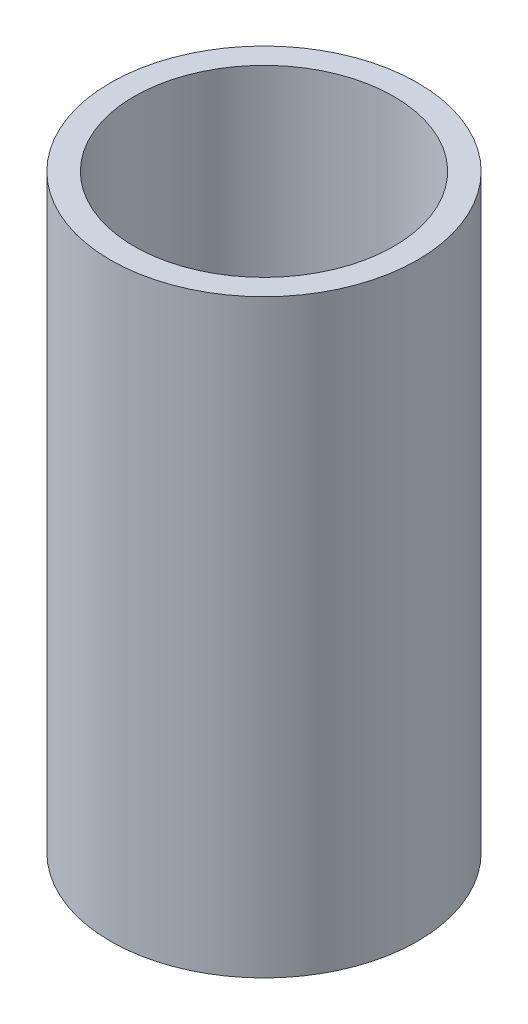
ISO-10303-21;
HEADER;
FILE_DESCRIPTION(('STEP AP214'),'2;1');
FILE_NAME('part.step','',(''),(''),'','','');
FILE_SCHEMA(('AUTOMOTIVE_DESIGN { 1 0 10303 214 1 1 1 1 }'));
ENDSEC;
DATA;
#1=APPLICATION_CONTEXT('core data for automotive mechanical design processes');
#2=APPLICATION_PROTOCOL_DEFINITION('international standard','automotive_design',2000,#1);
#3=PRODUCT_CONTEXT('',#1,'mechanical');
#4=PRODUCT('Part','Part','',(#3));
#5=PRODUCT_RELATED_PRODUCT_CATEGORY('part','',(#4));
#6=PRODUCT_DEFINITION_FORMATION('','',#4);
#7=PRODUCT_DEFINITION_CONTEXT('part definition',#1,'design');
#8=PRODUCT_DEFINITION('design','',#6,#7);
#9=PRODUCT_DEFINITION_SHAPE('','',#8);
#10=(LENGTH_UNIT() NAMED_UNIT(*) SI_UNIT(.MILLI.,.METRE.));
#11=(NAMED_UNIT(*) PLANE_ANGLE_UNIT() SI_UNIT($,.RADIAN.));
#12=(NAMED_UNIT(*) SI_UNIT($,.STERADIAN.) SOLID_ANGLE_UNIT());
#13=UNCERTAINTY_MEASURE_WITH_UNIT(LENGTH_MEASURE(1.E-05),#10,'distance_accuracy_value','');
#14=(GEOMETRIC_REPRESENTATION_CONTEXT(3) GLOBAL_UNCERTAINTY_ASSIGNED_CONTEXT((#13)) GLOBAL_UNIT_ASSIGNED_CONTEXT((#10,
#11,#12)) REPRESENTATION_CONTEXT('',''));
#15=CARTESIAN_POINT('',(0.,0.,0.));
#16=DIRECTION('',(0.,0.,1.));
#17=DIRECTION('',(1.,0.,0.));
#18=AXIS2_PLACEMENT_3D('',#15,#16,#17);
#19=CARTESIAN_POINT('',(0.,124.88153941635,0.));
#20=DIRECTION('',(0.,-1.,0.));
#21=DIRECTION('',(0.,0.,-1.));
#22=AXIS2_PLACEMENT_3D('',#19,#20,#21);
#23=CYLINDRICAL_SURFACE('',#22,32.5);
#24=CARTESIAN_POINT('',(0.,124.88153941635,0.));
#25=DIRECTION('',(0.,1.,0.));
#26=DIRECTION('',(0.,0.,1.));
#27=AXIS2_PLACEMENT_3D('',#24,#25,#26);
#28=CIRCLE('',#27,32.5);
#29=CARTESIAN_POINT('',(0.,124.88153941635,-32.5));
#30=VERTEX_POINT('',#29);
#31=EDGE_CURVE('E10',#30,#30,#28,.T.);
#32=CARTESIAN_POINT('',(0.,0.,0.));
#33=DIRECTION('',(0.,1.,0.));
#34=DIRECTION('',(0.,0.,1.));
#35=AXIS2_PLACEMENT_3D('',#32,#33,#34);
#36=CIRCLE('',#35,32.5);
#37=CARTESIAN_POINT('',(0.,0.,-32.5));
#38=VERTEX_POINT('',#37);
#39=EDGE_CURVE('E37',#38,#38,#36,.T.);
#40=CARTESIAN_POINT('',(0.,124.88153941635,-32.5));
#41=CARTESIAN_POINT('',(0.,123.58069004743,-32.5));
#42=CARTESIAN_POINT('',(0.,122.27984067851,-32.5));
#43=CARTESIAN_POINT('',(0.,119.678141940669,-32.5));
#44=CARTESIAN_POINT('',(0.,118.377292571749,-32.5));
#45=CARTESIAN_POINT('',(0.,115.775593833908,-32.5));
#46=CARTESIAN_POINT('',(0.,114.474744464988,-32.5));
#47=CARTESIAN_POINT('',(0.,111.873045727147,-32.5));
#48=CARTESIAN_POINT('',(0.,110.572196358227,-32.5));
#49=CARTESIAN_POINT('',(0.,107.970497620386,-32.5));
#50=CARTESIAN_POINT('',(0.,106.669648251466,-32.5));
#51=CARTESIAN_POINT('',(0.,104.067949513625,-32.5));
#52=CARTESIAN_POINT('',(0.,102.767100144705,-32.5));
#53=CARTESIAN_POINT('',(0.,100.165401406864,-32.5));
#54=CARTESIAN_POINT('',(0.,98.864552037944,-32.5));
#55=CARTESIAN_POINT('',(0.,96.2628533001034,-32.5));
#56=CARTESIAN_POINT('',(0.,94.962003931183,-32.5));
#57=CARTESIAN_POINT('',(0.,92.3603051933424,-32.5));
#58=CARTESIAN_POINT('',(0.,91.0594558244221,-32.5));
#59=CARTESIAN_POINT('',(0.,88.4577570865815,-32.5));
#60=CARTESIAN_POINT('',(0.,87.1569077176612,-32.5));
#61=CARTESIAN_POINT('',(0.,84.5552089798205,-32.5));
#62=CARTESIAN_POINT('',(0.,83.2543596109002,-32.5));
#63=CARTESIAN_POINT('',(0.,80.6526608730596,-32.5));
#64=CARTESIAN_POINT('',(0.,79.3518115041393,-32.5));
#65=CARTESIAN_POINT('',(0.,76.7501127662986,-32.5));
#66=CARTESIAN_POINT('',(0.,75.4492633973783,-32.5));
#67=CARTESIAN_POINT('',(0.,72.8475646595377,-32.5));
#68=CARTESIAN_POINT('',(0.,71.5467152906174,-32.5));
#69=CARTESIAN_POINT('',(0.,68.9450165527767,-32.5));
#70=CARTESIAN_POINT('',(0.,67.6441671838564,-32.5));
#71=CARTESIAN_POINT('',(0.,65.0424684460158,-32.5));
#72=CARTESIAN_POINT('',(0.,63.7416190770955,-32.5));
#73=CARTESIAN_POINT('',(0.,61.1399203392548,-32.5));
#74=CARTESIAN_POINT('',(0.,59.8390709703345,-32.5));
#75=CARTESIAN_POINT('',(0.,57.2373722324939,-32.5));
#76=CARTESIAN_POINT('',(0.,55.9365228635736,-32.5));
#77=CARTESIAN_POINT('',(0.,53.334824125733,-32.5));
#78=CARTESIAN_POINT('',(0.,52.0339747568126,-32.5));
#79=CARTESIAN_POINT('',(0.,49.432276018972,-32.5));
#80=CARTESIAN_POINT('',(0.,48.1314266500517,-32.5));
#81=CARTESIAN_POINT('',(0.,45.5297279122111,-32.5));
#82=CARTESIAN_POINT('',(0.,44.2288785432907,-32.5));
#83=CARTESIAN_POINT('',(0.,41.6271798054501,-32.5));
#84=CARTESIAN_POINT('',(0.,40.3263304365298,-32.5));
#85=CARTESIAN_POINT('',(0.,37.7246316986892,-32.5));
#86=CARTESIAN_POINT('',(0.,36.4237823297688,-32.5));
#87=CARTESIAN_POINT('',(0.,33.8220835919282,-32.5));
#88=CARTESIAN_POINT('',(0.,32.5212342230079,-32.5));
#89=CARTESIAN_POINT('',(0.,29.9195354851673,-32.5));
#90=CARTESIAN_POINT('',(0.,28.6186861162469,-32.5));
#91=CARTESIAN_POINT('',(0.,26.0169873784063,-32.5));
#92=CARTESIAN_POINT('',(0.,24.716138009486,-32.5));
#93=CARTESIAN_POINT('',(0.,22.1144392716454,-32.5));
#94=CARTESIAN_POINT('',(0.,20.813589902725,-32.5));
#95=CARTESIAN_POINT('',(0.,18.2118911648844,-32.5));
#96=CARTESIAN_POINT('',(0.,16.9110417959641,-32.5));
#97=CARTESIAN_POINT('',(0.,14.3093430581235,-32.5));
#98=CARTESIAN_POINT('',(0.,13.0084936892031,-32.5));
#99=CARTESIAN_POINT('',(0.,10.4067949513625,-32.5));
#100=CARTESIAN_POINT('',(0.,9.1059455824422,-32.5));
#101=CARTESIAN_POINT('',(0.,6.50424684460157,-32.5));
#102=CARTESIAN_POINT('',(0.,5.20339747568125,-32.5));
#103=CARTESIAN_POINT('',(0.,2.60169873784062,-32.5));
#104=CARTESIAN_POINT('',(0.,1.3008493689203,-32.5));
#105=CARTESIAN_POINT('',(0.,0.,-32.5));
#106=B_SPLINE_CURVE_WITH_KNOTS('',3,(#40,#41,#42,#43,#44,#45,#46,#47,#48,#49,#50,#51,#52,#53,
#54,#55,#56,#57,#58,#59,#60,#61,#62,#63,#64,#65,#66,#67,#68,#69,#70,#71,#72,#73,#74,#75,#76,#77,
#78,#79,#80,#81,#82,#83,#84,#85,#86,#87,#88,#89,#90,#91,#92,#93,#94,#95,#96,#97,#98,#99,#100,
#101,#102,#103,#104,#105),.UNSPECIFIED.,.F.,.F.,(4,2,2,2,2,2,2,2,2,2,2,2,2,2,2,2,2,2,2,2,2,2,2,
2,2,2,2,2,2,2,2,2,4),(0.,3.90254810676094,7.80509621352189,11.7076443202828,15.6101924270438,
19.5127405338047,23.4152886405657,27.3178367473266,31.2203848540876,35.1229329608485,
39.0254810676095,42.9280291743704,46.8305772811314,50.7331253878923,54.6356734946533,
58.5382216014142,62.4407697081752,66.3433178149361,70.2458659216971,74.148414028458,
78.050962135219,81.9535102419799,85.8560583487408,89.7586064555018,93.6611545622628,
97.5637026690237,101.466250775785,105.368798882546,109.271346989307,113.173895096067,
117.076443202828,120.978991309589,124.88153941635),.UNSPECIFIED.);
#107=EDGE_CURVE('BSEAM40',#30,#38,#106,.T.);
#108=ORIENTED_EDGE('',*,*,#31,.F.);
#109=ORIENTED_EDGE('',*,*,#39,.T.);
#110=ORIENTED_EDGE('',*,*,#107,.T.);
#111=ORIENTED_EDGE('',*,*,#107,.F.);
#112=EDGE_LOOP('',(#108,#110,#109,#111));
#113=FACE_BOUND('',#112,.T.);
#114=ADVANCED_FACE('F40',(#113),#23,.T.);
#115=CARTESIAN_POINT('',(0.,124.88153941635,0.));
#116=DIRECTION('',(0.,1.,0.));
#117=DIRECTION('',(0.,0.,1.));
#118=AXIS2_PLACEMENT_3D('',#115,#116,#117);
#119=PLANE('',#118);
#120=CARTESIAN_POINT('',(0.,124.88153941635,0.));
#121=DIRECTION('',(0.,1.,0.));
#122=DIRECTION('',(0.,0.,1.));
#123=AXIS2_PLACEMENT_3D('',#120,#121,#122);
#124=CIRCLE('',#123,27.4878555200863);
#125=CARTESIAN_POINT('',(0.,124.88153941635,-27.4878555200863));
#126=VERTEX_POINT('',#125);
#127=EDGE_CURVE('E50',#126,#126,#124,.T.);
#128=ORIENTED_EDGE('',*,*,#127,.F.);
#129=EDGE_LOOP('',(#128));
#130=FACE_BOUND('',#129,.T.);
#131=ORIENTED_EDGE('',*,*,#31,.T.);
#132=EDGE_LOOP('',(#131));
#133=FACE_BOUND('',#132,.T.);
#134=ADVANCED_FACE('F59',(#130,#133),#119,.T.);
#135=CARTESIAN_POINT('',(0.,0.,0.));
#136=DIRECTION('',(0.,1.,0.));
#137=DIRECTION('',(0.,0.,1.));
#138=AXIS2_PLACEMENT_3D('',#135,#136,#137);
#139=PLANE('',#138);
#140=CARTESIAN_POINT('',(0.,0.,0.));
#141=DIRECTION('',(0.,1.,0.));
#142=DIRECTION('',(0.,0.,1.));
#143=AXIS2_PLACEMENT_3D('',#140,#141,#142);
#144=CIRCLE('',#143,27.4878555200863);
#145=CARTESIAN_POINT('',(0.,0.,-27.4878555200863));
#146=VERTEX_POINT('',#145);
#147=EDGE_CURVE('E47',#146,#146,#144,.T.);
#148=ORIENTED_EDGE('',*,*,#147,.T.);
#149=EDGE_LOOP('',(#148));
#150=FACE_BOUND('',#149,.T.);
#151=ORIENTED_EDGE('',*,*,#39,.F.);
#152=EDGE_LOOP('',(#151));
#153=FACE_BOUND('',#152,.T.);
#154=ADVANCED_FACE('F58',(#150,#153),#139,.F.);
#155=CARTESIAN_POINT('',(0.,124.88153941635,0.));
#156=DIRECTION('',(0.,-1.,0.));
#157=DIRECTION('',(0.,0.,-1.));
#158=AXIS2_PLACEMENT_3D('',#155,#156,#157);
#159=CYLINDRICAL_SURFACE('',#158,27.4878555200863);
#160=CARTESIAN_POINT('',(0.,124.88153941635,-27.4878555200863));
#161=CARTESIAN_POINT('',(0.,123.58069004743,-27.4878555200863));
#162=CARTESIAN_POINT('',(0.,122.27984067851,-27.4878555200863));
#163=CARTESIAN_POINT('',(0.,119.678141940669,-27.4878555200863));
#164=CARTESIAN_POINT('',(0.,118.377292571749,-27.4878555200863));
#165=CARTESIAN_POINT('',(0.,115.775593833908,-27.4878555200863));
#166=CARTESIAN_POINT('',(0.,114.474744464988,-27.4878555200863));
#167=CARTESIAN_POINT('',(0.,111.873045727147,-27.4878555200863));
#168=CARTESIAN_POINT('',(0.,110.572196358227,-27.4878555200863));
#169=CARTESIAN_POINT('',(0.,107.970497620386,-27.4878555200863));
#170=CARTESIAN_POINT('',(0.,106.669648251466,-27.4878555200863));
#171=CARTESIAN_POINT('',(0.,104.067949513625,-27.4878555200863));
#172=CARTESIAN_POINT('',(0.,102.767100144705,-27.4878555200863));
#173=CARTESIAN_POINT('',(0.,100.165401406864,-27.4878555200863));
#174=CARTESIAN_POINT('',(0.,98.864552037944,-27.4878555200863));
#175=CARTESIAN_POINT('',(0.,96.2628533001034,-27.4878555200863));
#176=CARTESIAN_POINT('',(0.,94.962003931183,-27.4878555200863));
#177=CARTESIAN_POINT('',(0.,92.3603051933424,-27.4878555200863));
#178=CARTESIAN_POINT('',(0.,91.0594558244221,-27.4878555200863));
#179=CARTESIAN_POINT('',(0.,88.4577570865815,-27.4878555200863));
#180=CARTESIAN_POINT('',(0.,87.1569077176612,-27.4878555200863));
#181=CARTESIAN_POINT('',(0.,84.5552089798205,-27.4878555200863));
#182=CARTESIAN_POINT('',(0.,83.2543596109002,-27.4878555200863));
#183=CARTESIAN_POINT('',(0.,80.6526608730596,-27.4878555200863));
#184=CARTESIAN_POINT('',(0.,79.3518115041393,-27.4878555200863));
#185=CARTESIAN_POINT('',(0.,76.7501127662986,-27.4878555200863));
#186=CARTESIAN_POINT('',(0.,75.4492633973783,-27.4878555200863));
#187=CARTESIAN_POINT('',(0.,72.8475646595377,-27.4878555200863));
#188=CARTESIAN_POINT('',(0.,71.5467152906174,-27.4878555200863));
#189=CARTESIAN_POINT('',(0.,68.9450165527767,-27.4878555200863));
#190=CARTESIAN_POINT('',(0.,67.6441671838564,-27.4878555200863));
#191=CARTESIAN_POINT('',(0.,65.0424684460158,-27.4878555200863));
#192=CARTESIAN_POINT('',(0.,63.7416190770955,-27.4878555200863));
#193=CARTESIAN_POINT('',(0.,61.1399203392548,-27.4878555200863));
#194=CARTESIAN_POINT('',(0.,59.8390709703345,-27.4878555200863));
#195=CARTESIAN_POINT('',(0.,57.2373722324939,-27.4878555200863));
#196=CARTESIAN_POINT('',(0.,55.9365228635736,-27.4878555200863));
#197=CARTESIAN_POINT('',(0.,53.334824125733,-27.4878555200863));
#198=CARTESIAN_POINT('',(0.,52.0339747568126,-27.4878555200863));
#199=CARTESIAN_POINT('',(0.,49.432276018972,-27.4878555200863));
#200=CARTESIAN_POINT('',(0.,48.1314266500517,-27.4878555200863));
#201=CARTESIAN_POINT('',(0.,45.5297279122111,-27.4878555200863));
#202=CARTESIAN_POINT('',(0.,44.2288785432907,-27.4878555200863));
#203=CARTESIAN_POINT('',(0.,41.6271798054501,-27.4878555200863));
#204=CARTESIAN_POINT('',(0.,40.3263304365298,-27.4878555200863));
#205=CARTESIAN_POINT('',(0.,37.7246316986892,-27.4878555200863));
#206=CARTESIAN_POINT('',(0.,36.4237823297688,-27.4878555200863));
#207=CARTESIAN_POINT('',(0.,33.8220835919282,-27.4878555200863));
#208=CARTESIAN_POINT('',(0.,32.5212342230079,-27.4878555200863));
#209=CARTESIAN_POINT('',(0.,29.9195354851673,-27.4878555200863));
#210=CARTESIAN_POINT('',(0.,28.6186861162469,-27.4878555200863));
#211=CARTESIAN_POINT('',(0.,26.0169873784063,-27.4878555200863));
#212=CARTESIAN_POINT('',(0.,24.716138009486,-27.4878555200863));
#213=CARTESIAN_POINT('',(0.,22.1144392716454,-27.4878555200863));
#214=CARTESIAN_POINT('',(0.,20.813589902725,-27.4878555200863));
#215=CARTESIAN_POINT('',(0.,18.2118911648844,-27.4878555200863));
#216=CARTESIAN_POINT('',(0.,16.9110417959641,-27.4878555200863));
#217=CARTESIAN_POINT('',(0.,14.3093430581235,-27.4878555200863));
#218=CARTESIAN_POINT('',(0.,13.0084936892031,-27.4878555200863));
#219=CARTESIAN_POINT('',(0.,10.4067949513625,-27.4878555200863));
#220=CARTESIAN_POINT('',(0.,9.1059455824422,-27.4878555200863));
#221=CARTESIAN_POINT('',(0.,6.50424684460157,-27.4878555200863));
#222=CARTESIAN_POINT('',(0.,5.20339747568125,-27.4878555200863));
#223=CARTESIAN_POINT('',(0.,2.60169873784062,-27.4878555200863));
#224=CARTESIAN_POINT('',(0.,1.3008493689203,-27.4878555200863));
#225=CARTESIAN_POINT('',(0.,0.,-27.4878555200863));
#226=B_SPLINE_CURVE_WITH_KNOTS('',3,(#160,#161,#162,#163,#164,#165,#166,#167,#168,#169,#170,
#171,#172,#173,#174,#175,#176,#177,#178,#179,#180,#181,#182,#183,#184,#185,#186,#187,#188,#189,
#190,#191,#192,#193,#194,#195,#196,#197,#198,#199,#200,#201,#202,#203,#204,#205,#206,#207,#208,
#209,#210,#211,#212,#213,#214,#215,#216,#217,#218,#219,#220,#221,#222,#223,#224,#225),
.UNSPECIFIED.,.F.,.F.,(4,2,2,2,2,2,2,2,2,2,2,2,2,2,2,2,2,2,2,2,2,2,2,2,2,2,2,2,2,2,2,2,4),(0.,
3.90254810676094,7.80509621352189,11.7076443202828,15.6101924270438,19.5127405338047,
23.4152886405657,27.3178367473266,31.2203848540876,35.1229329608485,39.0254810676095,
42.9280291743704,46.8305772811314,50.7331253878923,54.6356734946533,58.5382216014142,
62.4407697081752,66.3433178149361,70.2458659216971,74.148414028458,78.050962135219,
81.9535102419799,85.8560583487408,89.7586064555018,93.6611545622628,97.5637026690237,
101.466250775785,105.368798882546,109.271346989307,113.173895096067,117.076443202828,
120.978991309589,124.88153941635),.UNSPECIFIED.);
#227=EDGE_CURVE('BSEAM54',#126,#146,#226,.T.);
#228=ORIENTED_EDGE('',*,*,#127,.T.);
#229=ORIENTED_EDGE('',*,*,#147,.F.);
#230=ORIENTED_EDGE('',*,*,#227,.T.);
#231=ORIENTED_EDGE('',*,*,#227,.F.);
#232=EDGE_LOOP('',(#228,#230,#229,#231));
#233=FACE_BOUND('',#232,.T.);
#234=ADVANCED_FACE('F54',(#233),#159,.F.);
#235=CLOSED_SHELL('',(#114,#134,#154,#234));
#236=MANIFOLD_SOLID_BREP('B2',#235);
#237=ADVANCED_BREP_SHAPE_REPRESENTATION('',(#18,#236),#14);
#238=SHAPE_DEFINITION_REPRESENTATION(#9,#237);
ENDSEC;
END-ISO-10303-21;
